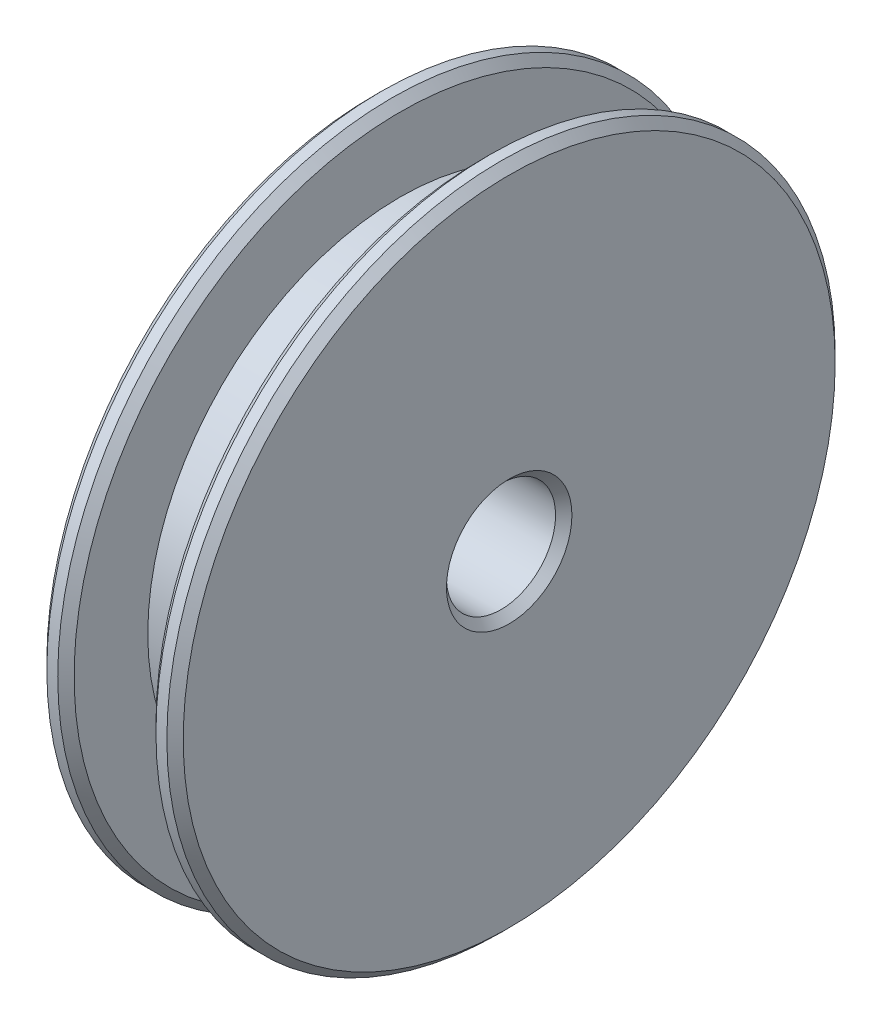
ISO-10303-21;
HEADER;
FILE_DESCRIPTION(('STEP AP214'),'2;1');
FILE_NAME('part.step','',(''),(''),'','','');
FILE_SCHEMA(('AUTOMOTIVE_DESIGN { 1 0 10303 214 1 1 1 1 }'));
ENDSEC;
DATA;
#1=APPLICATION_CONTEXT('core data for automotive mechanical design processes');
#2=APPLICATION_PROTOCOL_DEFINITION('international standard','automotive_design',2000,#1);
#3=PRODUCT_CONTEXT('',#1,'mechanical');
#4=PRODUCT('Part','Part','',(#3));
#5=PRODUCT_RELATED_PRODUCT_CATEGORY('part','',(#4));
#6=PRODUCT_DEFINITION_FORMATION('','',#4);
#7=PRODUCT_DEFINITION_CONTEXT('part definition',#1,'design');
#8=PRODUCT_DEFINITION('design','',#6,#7);
#9=PRODUCT_DEFINITION_SHAPE('','',#8);
#10=(LENGTH_UNIT() NAMED_UNIT(*) SI_UNIT(.MILLI.,.METRE.));
#11=(NAMED_UNIT(*) PLANE_ANGLE_UNIT() SI_UNIT($,.RADIAN.));
#12=(NAMED_UNIT(*) SI_UNIT($,.STERADIAN.) SOLID_ANGLE_UNIT());
#13=UNCERTAINTY_MEASURE_WITH_UNIT(LENGTH_MEASURE(1.E-05),#10,'distance_accuracy_value','');
#14=(GEOMETRIC_REPRESENTATION_CONTEXT(3) GLOBAL_UNCERTAINTY_ASSIGNED_CONTEXT((#13)) GLOBAL_UNIT_ASSIGNED_CONTEXT((#10,
#11,#12)) REPRESENTATION_CONTEXT('',''));
#15=CARTESIAN_POINT('',(0.,0.,0.));
#16=DIRECTION('',(0.,0.,1.));
#17=DIRECTION('',(1.,0.,0.));
#18=AXIS2_PLACEMENT_3D('',#15,#16,#17);
#19=CARTESIAN_POINT('',(0.,0.,0.));
#20=DIRECTION('',(-1.,0.,0.));
#21=DIRECTION('',(0.,0.,1.));
#22=AXIS2_PLACEMENT_3D('',#19,#20,#21);
#23=CYLINDRICAL_SURFACE('',#22,2.);
#24=CARTESIAN_POINT('',(9.19999999999999,0.,0.));
#25=DIRECTION('',(1.,0.,0.));
#26=DIRECTION('',(0.,0.,-1.));
#27=AXIS2_PLACEMENT_3D('',#24,#25,#26);
#28=CIRCLE('',#27,2.);
#29=CARTESIAN_POINT('',(9.19999999999999,0.,-2.));
#30=VERTEX_POINT('',#29);
#31=EDGE_CURVE('E170',#30,#30,#28,.T.);
#32=ORIENTED_EDGE('',*,*,#31,.T.);
#33=EDGE_LOOP('',(#32));
#34=FACE_BOUND('',#33,.T.);
#35=CARTESIAN_POINT('',(0.299999999999993,0.,0.));
#36=DIRECTION('',(1.,0.,0.));
#37=DIRECTION('',(0.,0.,-1.));
#38=AXIS2_PLACEMENT_3D('',#35,#36,#37);
#39=CIRCLE('',#38,2.);
#40=CARTESIAN_POINT('',(0.299999999999993,0.,-2.));
#41=VERTEX_POINT('',#40);
#42=EDGE_CURVE('E173',#41,#41,#39,.F.);
#43=ORIENTED_EDGE('',*,*,#42,.T.);
#44=EDGE_LOOP('',(#43));
#45=FACE_BOUND('',#44,.T.);
#46=CARTESIAN_POINT('',(7.85,0.,2.));
#47=CARTESIAN_POINT('',(7.84999485531506,-0.0454533691956192,1.99999610298521));
#48=CARTESIAN_POINT('',(7.84633260902487,-0.0909741237724375,1.99843267814324));
#49=CARTESIAN_POINT('',(7.8318155696716,-0.180721908730682,1.99232931963373));
#50=CARTESIAN_POINT('',(7.82094242990579,-0.224945337836552,1.9877817938186));
#51=CARTESIAN_POINT('',(7.79248120753885,-0.310651709191418,1.97619800288383));
#52=CARTESIAN_POINT('',(7.77491624354067,-0.352143516101832,1.96917031221161));
#53=CARTESIAN_POINT('',(7.73366735607275,-0.431549996691369,1.95330651712269));
#54=CARTESIAN_POINT('',(7.70998514923173,-0.469465669841503,1.94447092018736));
#55=CARTESIAN_POINT('',(7.65587976052907,-0.542669435590061,1.92535926070784));
#56=CARTESIAN_POINT('',(7.62519048713297,-0.577748101128574,1.91503480140104));
#57=CARTESIAN_POINT('',(7.55850533801077,-0.642442127963505,1.89431367403256));
#58=CARTESIAN_POINT('',(7.52250658187128,-0.672054504020533,1.88391696971344));
#59=CARTESIAN_POINT('',(7.44397163283228,-0.726489570806992,1.86362579212524));
#60=CARTESIAN_POINT('',(7.4011937614794,-0.750985724786075,1.85378502511931));
#61=CARTESIAN_POINT('',(7.31164689847335,-0.792341264830012,1.8364916311108));
#62=CARTESIAN_POINT('',(7.26488006051391,-0.809204741243102,1.8290377256183));
#63=CARTESIAN_POINT('',(7.17109370782744,-0.833942550523084,1.81788799782102));
#64=CARTESIAN_POINT('',(7.12420148777963,-0.842220821052611,1.81402429269854));
#65=CARTESIAN_POINT('',(7.02954668703068,-0.850812404303666,1.81001192331652));
#66=CARTESIAN_POINT('',(6.98178463096778,-0.851130368787563,1.80986108936811));
#67=CARTESIAN_POINT('',(6.89084638594808,-0.844095650813446,1.81315001237071));
#68=CARTESIAN_POINT('',(6.84761013946082,-0.837357397996349,1.81630217082056));
#69=CARTESIAN_POINT('',(6.76295289579606,-0.817435293190567,1.82535420422441));
#70=CARTESIAN_POINT('',(6.72153226489487,-0.804250147088479,1.83125463083916));
#71=CARTESIAN_POINT('',(6.64061459061202,-0.7715494237797,1.84527304709129));
#72=CARTESIAN_POINT('',(6.60117868257091,-0.751902856907674,1.85343632082439));
#73=CARTESIAN_POINT('',(6.52600594482056,-0.706930007631809,1.87105111673329));
#74=CARTESIAN_POINT('',(6.49027061447246,-0.681601436111337,1.88050315751273));
#75=CARTESIAN_POINT('',(6.42019348079294,-0.623360722197447,1.90064484729978));
#76=CARTESIAN_POINT('',(6.38625307307955,-0.589976546572498,1.91137009611481));
#77=CARTESIAN_POINT('',(6.32431473044174,-0.517888341795048,1.93214852473557));
#78=CARTESIAN_POINT('',(6.2963183012143,-0.479182968786319,1.94220153381236));
#79=CARTESIAN_POINT('',(6.24644123471822,-0.396289225002726,1.96081645134392));
#80=CARTESIAN_POINT('',(6.22473019433377,-0.351988346324726,1.96933501020278));
#81=CARTESIAN_POINT('',(6.18921099916799,-0.25990826771039,1.98358575052622));
#82=CARTESIAN_POINT('',(6.17539829563028,-0.212131087731184,1.98931953549159));
#83=CARTESIAN_POINT('',(6.15692262036468,-0.117803605483454,1.99705138766422));
#84=CARTESIAN_POINT('',(6.15172135916805,-0.0713767168908719,1.99926883018934));
#85=CARTESIAN_POINT('',(6.1490035610588,0.0217359650488923,2.00042313259768));
#86=CARTESIAN_POINT('',(6.1514847031591,0.0684216759473159,1.99936098330267));
#87=CARTESIAN_POINT('',(6.16368160827693,0.15816406305469,1.99421689879685));
#88=CARTESIAN_POINT('',(6.17301383752975,0.201283108380667,1.99029512539326));
#89=CARTESIAN_POINT('',(6.19810806385209,0.285292826143489,1.98000006016052));
#90=CARTESIAN_POINT('',(6.21387086485905,0.326183219233778,1.97362646181472));
#91=CARTESIAN_POINT('',(6.25189170509613,0.406017159274118,1.95878809411181));
#92=CARTESIAN_POINT('',(6.27433702119993,0.444860185104721,1.9502642938807));
#93=CARTESIAN_POINT('',(6.32488069927335,0.518368244124496,1.93202768317616));
#94=CARTESIAN_POINT('',(6.35298145989243,0.55303149453183,1.92231436887961));
#95=CARTESIAN_POINT('',(6.4164749242142,0.619902104784065,1.90184999483242));
#96=CARTESIAN_POINT('',(6.45225399178763,0.651736359196346,1.89107541423886));
#97=CARTESIAN_POINT('',(6.52880770509276,0.709059266407625,1.87033858424291));
#98=CARTESIAN_POINT('',(6.56958365649981,0.734546255381553,1.8603765482942));
#99=CARTESIAN_POINT('',(6.65594100823478,0.77879063756575,1.84229973935975));
#100=CARTESIAN_POINT('',(6.70159161560414,0.797427815218113,1.83421880198126));
#101=CARTESIAN_POINT('',(6.79583611113618,0.826586075766017,1.82126733168343));
#102=CARTESIAN_POINT('',(6.84442739974756,0.837114217174601,1.81639400723519));
#103=CARTESIAN_POINT('',(6.93901705018618,0.849040893251798,1.81084755056649));
#104=CARTESIAN_POINT('',(6.98491493498965,0.851097972334276,1.80987163394732));
#105=CARTESIAN_POINT('',(7.07637814740052,0.847796714926126,1.8114205168628));
#106=CARTESIAN_POINT('',(7.12194352994133,0.842439632567223,1.81394472433919));
#107=CARTESIAN_POINT('',(7.20907718878752,0.825022602727582,1.82192797471859));
#108=CARTESIAN_POINT('',(7.25073119067697,0.813313907363117,1.82723276934342));
#109=CARTESIAN_POINT('',(7.33148903296141,0.783877255858317,1.84005238289192));
#110=CARTESIAN_POINT('',(7.37059214711152,0.76614759437085,1.84756782786789));
#111=CARTESIAN_POINT('',(7.44776290625968,0.723920163433527,1.86453396385473));
#112=CARTESIAN_POINT('',(7.48561934646319,0.699073507320178,1.87407518241383));
#113=CARTESIAN_POINT('',(7.55683126387723,0.643795334394055,1.89377609827807));
#114=CARTESIAN_POINT('',(7.59018507322382,0.613361757872052,1.90393602275304));
#115=CARTESIAN_POINT('',(7.65409233199652,0.544992960322057,1.92466960832755));
#116=CARTESIAN_POINT('',(7.68423197173319,0.506660401940232,1.93521482698711));
#117=CARTESIAN_POINT('',(7.73767860922517,0.425096164183361,1.95475042990917));
#118=CARTESIAN_POINT('',(7.7609825072125,0.381862274509921,1.96374010803344));
#119=CARTESIAN_POINT('',(7.7996199138584,0.292319161030918,1.97903554560946));
#120=CARTESIAN_POINT('',(7.81506921093474,0.246066684743339,1.98538003116276));
#121=CARTESIAN_POINT('',(7.83781955712287,0.151373618625758,1.99482615738596));
#122=CARTESIAN_POINT('',(7.84514593214634,0.102940322491203,1.99793787536247));
#123=CARTESIAN_POINT('',(7.84942364590889,0.0362062000322417,1.9997555776352));
#124=CARTESIAN_POINT('',(7.85000204962272,0.018108447703111,2.00000155255573));
#125=CARTESIAN_POINT('',(7.85,0.,2.));
#126=B_SPLINE_CURVE_WITH_KNOTS('',3,(#46,#47,#48,#49,#50,#51,#52,#53,#54,#55,#56,#57,#58,#59,
#60,#61,#62,#63,#64,#65,#66,#67,#68,#69,#70,#71,#72,#73,#74,#75,#76,#77,#78,#79,#80,#81,#82,#83,
#84,#85,#86,#87,#88,#89,#90,#91,#92,#93,#94,#95,#96,#97,#98,#99,#100,#101,#102,#103,#104,#105,
#106,#107,#108,#109,#110,#111,#112,#113,#114,#115,#116,#117,#118,#119,#120,#121,#122,#123,#124,
#125),.UNSPECIFIED.,.T.,.F.,(4,2,2,2,2,2,2,2,2,2,2,2,2,2,2,2,2,2,2,2,2,2,2,2,2,2,2,2,2,2,2,2,2,
2,2,2,2,2,2,4),(0.,0.136307040293474,0.272962224477558,0.409149518129234,0.54529863616415,
0.687894487815835,0.830567984725648,0.980613328827404,1.13057816821904,1.27311370785288,
1.41556595207797,1.54656942935013,1.67759921433231,1.81146843344723,1.94539168179446,
2.09113553267629,2.23691625868103,2.3863260628409,2.53564973303489,2.67522845014003,
2.81476500221255,2.94703402435382,3.07931958757823,3.21573173032308,3.35220185208167,
3.49879868489879,3.64543390516936,3.7945319186785,3.94350000264553,4.08063948476886,
4.21775577209704,4.34796480873199,4.47821075589872,4.6164584845508,4.75475728320955,
4.90371253229748,5.05273522328959,5.19949230493043,5.3457905244665,5.40009472576998),.UNSPECIFIED.);
#127=CARTESIAN_POINT('',(7.85,0.,2.));
#128=VERTEX_POINT('',#127);
#129=EDGE_CURVE('E190',#128,#128,#126,.T.);
#130=ORIENTED_EDGE('',*,*,#129,.F.);
#131=EDGE_LOOP('',(#130));
#132=FACE_BOUND('',#131,.T.);
#133=ADVANCED_FACE('F132',(#34,#45,#132),#23,.F.);
#134=CARTESIAN_POINT('',(2.33899178982258,0.,0.));
#135=DIRECTION('',(-1.,0.,0.));
#136=DIRECTION('',(0.,0.,1.));
#137=AXIS2_PLACEMENT_3D('',#134,#135,#136);
#138=CYLINDRICAL_SURFACE('',#137,9.25);
#139=CARTESIAN_POINT('',(5.5,0.,0.));
#140=DIRECTION('',(-1.,0.,0.));
#141=DIRECTION('',(0.,0.,1.));
#142=AXIS2_PLACEMENT_3D('',#139,#140,#141);
#143=CIRCLE('',#142,9.25);
#144=CARTESIAN_POINT('',(5.5,0.,9.25));
#145=VERTEX_POINT('',#144);
#146=EDGE_CURVE('E255',#145,#145,#143,.T.);
#147=ORIENTED_EDGE('',*,*,#146,.F.);
#148=EDGE_LOOP('',(#147));
#149=FACE_BOUND('',#148,.T.);
#150=CARTESIAN_POINT('',(8.5,0.,0.));
#151=DIRECTION('',(-1.,0.,0.));
#152=DIRECTION('',(0.,0.,1.));
#153=AXIS2_PLACEMENT_3D('',#150,#151,#152);
#154=CIRCLE('',#153,9.25);
#155=CARTESIAN_POINT('',(8.5,0.,9.25));
#156=VERTEX_POINT('',#155);
#157=EDGE_CURVE('E211',#156,#156,#154,.T.);
#158=ORIENTED_EDGE('',*,*,#157,.T.);
#159=EDGE_LOOP('',(#158));
#160=FACE_BOUND('',#159,.T.);
#161=CARTESIAN_POINT('',(7.85,0.,9.25));
#162=CARTESIAN_POINT('',(7.84999792776888,-0.0476370846732466,9.24999949222256));
#163=CARTESIAN_POINT('',(7.84598189077624,-0.0953061404503285,9.24962808998843));
#164=CARTESIAN_POINT('',(7.83002099415769,-0.189324036851098,9.24818220410719));
#165=CARTESIAN_POINT('',(7.81806727317002,-0.235671341538837,9.24710693470568));
#166=CARTESIAN_POINT('',(7.78658075080506,-0.32567055159058,9.24437476036882));
#167=CARTESIAN_POINT('',(7.76705238001349,-0.369324015374126,9.24271819550035));
#168=CARTESIAN_POINT('',(7.72097916066193,-0.452723509936903,9.23900893875692));
#169=CARTESIAN_POINT('',(7.69443576100248,-0.492470345277323,9.23695632870566));
#170=CARTESIAN_POINT('',(7.6349984070634,-0.567060120939312,9.23267808063553));
#171=CARTESIAN_POINT('',(7.60208736641374,-0.601889420980146,9.23045198692563));
#172=CARTESIAN_POINT('',(7.53088525103166,-0.665538307976645,9.22608146208895));
#173=CARTESIAN_POINT('',(7.49259393405423,-0.694357624189745,9.2239370346447));
#174=CARTESIAN_POINT('',(7.41163413275954,-0.745215788343305,9.21996787730021));
#175=CARTESIAN_POINT('',(7.36895796795899,-0.76724245878165,9.21814372406245));
#176=CARTESIAN_POINT('',(7.28049328194995,-0.803812306017037,9.2150271081286));
#177=CARTESIAN_POINT('',(7.23470482646198,-0.818355640779976,9.2137346342094));
#178=CARTESIAN_POINT('',(7.1414533333211,-0.839505950963499,9.21183170543771));
#179=CARTESIAN_POINT('',(7.09399542565822,-0.846135368093439,9.21121932237905));
#180=CARTESIAN_POINT('',(6.99863686453393,-0.851339008390021,9.21073987705125));
#181=CARTESIAN_POINT('',(6.95073622103734,-0.84991341241558,9.21087279804782));
#182=CARTESIAN_POINT('',(6.85600614717573,-0.839066015658612,9.21186718536504));
#183=CARTESIAN_POINT('',(6.80917389098237,-0.829668659981251,9.21272642442989));
#184=CARTESIAN_POINT('',(6.7177541619531,-0.80318250681332,9.2150731476958));
#185=CARTESIAN_POINT('',(6.67316671518585,-0.786093620024984,9.21656063919077));
#186=CARTESIAN_POINT('',(6.58742471043244,-0.744682315718184,9.21999882913122));
#187=CARTESIAN_POINT('',(6.54627544961112,-0.720348990700538,9.22195022514972));
#188=CARTESIAN_POINT('',(6.46863583953017,-0.665147393901243,9.22609573560569));
#189=CARTESIAN_POINT('',(6.4321456053033,-0.63427896081581,9.22828985603359));
#190=CARTESIAN_POINT('',(6.3647177788951,-0.566746565367757,9.23268351161205));
#191=CARTESIAN_POINT('',(6.33380133730989,-0.53006148055265,9.23488303656137));
#192=CARTESIAN_POINT('',(6.27856242927357,-0.452010657179427,9.23903193339905));
#193=CARTESIAN_POINT('',(6.25423996858449,-0.41064491453125,9.24098130506882));
#194=CARTESIAN_POINT('',(6.21288053439215,-0.324392803975308,9.24441075330544));
#195=CARTESIAN_POINT('',(6.1958445645894,-0.279505952048454,9.2458907652116));
#196=CARTESIAN_POINT('',(6.1695568487732,-0.187492399736341,9.2482140398282));
#197=CARTESIAN_POINT('',(6.16030490627145,-0.140365755920758,9.24905731861133));
#198=CARTESIAN_POINT('',(6.14987454588273,-0.0453936206943293,9.25001004942673));
#199=CARTESIAN_POINT('',(6.14866692741954,0.00244863825002978,9.25012215555564));
#200=CARTESIAN_POINT('',(6.15428290180991,0.0976548975945362,9.24960701224893));
#201=CARTESIAN_POINT('',(6.16110640329972,0.145018903429211,9.24897977122429));
#202=CARTESIAN_POINT('',(6.18256670965705,0.237840404669015,9.24705814915379));
#203=CARTESIAN_POINT('',(6.19718991207794,0.28330107103378,9.24576492968959));
#204=CARTESIAN_POINT('',(6.23382058617286,0.371123824126125,9.24265652962257));
#205=CARTESIAN_POINT('',(6.25582819877559,0.413485851698552,9.24084133905823));
#206=CARTESIAN_POINT('',(6.30667588584271,0.494041289277799,9.23688564547915));
#207=CARTESIAN_POINT('',(6.33553522683663,0.532222492542615,9.23474423134656));
#208=CARTESIAN_POINT('',(6.39923943027125,0.603209069334763,9.23037952046517));
#209=CARTESIAN_POINT('',(6.43408441928737,0.636014329151113,9.22815622198557));
#210=CARTESIAN_POINT('',(6.50889785533252,0.695418563850993,9.22387040046341));
#211=CARTESIAN_POINT('',(6.54888150872717,0.721998429645741,9.22180838506019));
#212=CARTESIAN_POINT('',(6.63276193314079,0.768066180954811,9.21808606850965));
#213=CARTESIAN_POINT('',(6.67665865791947,0.787554150259378,9.21642576261623));
#214=CARTESIAN_POINT('',(6.76705254204956,0.818852640161989,9.21369787286049));
#215=CARTESIAN_POINT('',(6.81354567896371,0.830674697263945,9.21262939869995));
#216=CARTESIAN_POINT('',(6.90786732315413,0.846343276586317,9.21120328398292));
#217=CARTESIAN_POINT('',(6.95569579857248,0.85018998891447,9.21084562648274));
#218=CARTESIAN_POINT('',(7.05114053264695,0.849796274447336,9.21088194465917));
#219=CARTESIAN_POINT('',(7.09875691906342,0.84558586827335,9.21127313016742));
#220=CARTESIAN_POINT('',(7.19260305597119,0.82926020374282,9.21275711944008));
#221=CARTESIAN_POINT('',(7.23883280460083,0.817144934773928,9.21384992414641));
#222=CARTESIAN_POINT('',(7.32859423752347,0.785361399650265,9.21661326722427));
#223=CARTESIAN_POINT('',(7.37212617581526,0.765693845801492,9.21828375110958));
#224=CARTESIAN_POINT('',(7.45527552482868,0.719367239060225,9.22201433698682));
#225=CARTESIAN_POINT('',(7.49489297750478,0.692708261111239,9.22407443480228));
#226=CARTESIAN_POINT('',(7.56924256209657,0.633042689391483,9.22836129630614));
#227=CARTESIAN_POINT('',(7.6039567515893,0.600013778082753,9.23058862864503));
#228=CARTESIAN_POINT('',(7.66736412194514,0.528588559541346,9.23495378857713));
#229=CARTESIAN_POINT('',(7.69605585129989,0.490190962076994,9.2370915944939));
#230=CARTESIAN_POINT('',(7.74665118571887,0.409028933190393,9.24104152502463));
#231=CARTESIAN_POINT('',(7.76853985555525,0.366255164087783,9.24285292945669));
#232=CARTESIAN_POINT('',(7.80479571759602,0.277651026926508,9.24593785945556));
#233=CARTESIAN_POINT('',(7.81917147461022,0.231824206904294,9.24721199719118));
#234=CARTESIAN_POINT('',(7.83636972667363,0.154776930048339,9.24875514108906));
#235=CARTESIAN_POINT('',(7.84147419257583,0.124050560039465,9.24921981272009));
#236=CARTESIAN_POINT('',(7.84829000035717,0.0622206730630395,9.24984240750493));
#237=CARTESIAN_POINT('',(7.85000135360806,0.0311171573598129,9.25000033168677));
#238=CARTESIAN_POINT('',(7.85,0.,9.25));
#239=B_SPLINE_CURVE_WITH_KNOTS('',3,(#161,#162,#163,#164,#165,#166,#167,#168,#169,#170,#171,
#172,#173,#174,#175,#176,#177,#178,#179,#180,#181,#182,#183,#184,#185,#186,#187,#188,#189,#190,
#191,#192,#193,#194,#195,#196,#197,#198,#199,#200,#201,#202,#203,#204,#205,#206,#207,#208,#209,
#210,#211,#212,#213,#214,#215,#216,#217,#218,#219,#220,#221,#222,#223,#224,#225,#226,#227,#228,
#229,#230,#231,#232,#233,#234,#235,#236,#237,#238),.UNSPECIFIED.,.T.,.F.,(4,2,2,2,2,2,2,2,2,2,2,
2,2,2,2,2,2,2,2,2,2,2,2,2,2,2,2,2,2,2,2,2,2,2,2,2,2,2,4),(0.,0.142797634317748,
0.285754951690397,0.428628775854004,0.571473113553022,0.714706200527788,0.857945738588177,
1.00144059591486,1.14493242408117,1.2880163746202,1.43109711251326,1.573740678081,
1.71638589976642,1.85924698908744,2.00211160500987,2.14550742712782,2.28890337454915,
2.43231906813746,2.57573114144636,2.71862234960822,2.86151193222479,3.00415313055653,
3.14679705129684,3.28984692809645,3.4328998302707,3.57638624669538,3.71987096778339,
3.86313925311516,4.00640412333154,4.14913623141389,4.29186853111575,4.43458737209443,
4.5773046832827,4.72053140987001,4.86379261683258,5.0073661490239,5.15077564666699,
5.24405321350629,5.33733046773276),.UNSPECIFIED.);
#240=CARTESIAN_POINT('',(7.85,0.,9.25));
#241=VERTEX_POINT('',#240);
#242=EDGE_CURVE('E183',#241,#241,#239,.T.);
#243=ORIENTED_EDGE('',*,*,#242,.T.);
#244=EDGE_LOOP('',(#243));
#245=FACE_BOUND('',#244,.T.);
#246=ADVANCED_FACE('F192',(#149,#160,#245),#138,.T.);
#247=CARTESIAN_POINT('',(0.,0.,0.));
#248=DIRECTION('',(-1.,0.,0.));
#249=DIRECTION('',(0.,0.,1.));
#250=AXIS2_PLACEMENT_3D('',#247,#248,#249);
#251=CYLINDRICAL_SURFACE('',#250,4.5);
#252=CARTESIAN_POINT('',(0.299999999999998,0.,0.));
#253=DIRECTION('',(1.,0.,0.));
#254=DIRECTION('',(0.,0.,-1.));
#255=AXIS2_PLACEMENT_3D('',#252,#253,#254);
#256=CIRCLE('',#255,4.5);
#257=CARTESIAN_POINT('',(0.299999999999998,0.,-4.5));
#258=VERTEX_POINT('',#257);
#259=EDGE_CURVE('E161',#258,#258,#256,.T.);
#260=ORIENTED_EDGE('',*,*,#259,.T.);
#261=EDGE_LOOP('',(#260));
#262=FACE_BOUND('',#261,.T.);
#263=CARTESIAN_POINT('',(4.5,0.,0.));
#264=DIRECTION('',(-1.,0.,0.));
#265=DIRECTION('',(0.,0.,1.));
#266=AXIS2_PLACEMENT_3D('',#263,#264,#265);
#267=CIRCLE('',#266,4.5);
#268=CARTESIAN_POINT('',(4.5,0.,4.5));
#269=VERTEX_POINT('',#268);
#270=EDGE_CURVE('E182',#269,#269,#267,.F.);
#271=ORIENTED_EDGE('',*,*,#270,.F.);
#272=EDGE_LOOP('',(#271));
#273=FACE_BOUND('',#272,.T.);
#274=ADVANCED_FACE('F264',(#262,#273),#251,.T.);
#275=CARTESIAN_POINT('',(0.,4.5,0.));
#276=DIRECTION('',(1.,0.,0.));
#277=DIRECTION('',(0.,0.,-1.));
#278=AXIS2_PLACEMENT_3D('',#275,#276,#277);
#279=PLANE('',#278);
#280=CARTESIAN_POINT('',(0.,0.,0.));
#281=DIRECTION('',(1.,0.,0.));
#282=DIRECTION('',(0.,0.,-1.));
#283=AXIS2_PLACEMENT_3D('',#280,#281,#282);
#284=CIRCLE('',#283,2.3);
#285=CARTESIAN_POINT('',(0.,0.,-2.3));
#286=VERTEX_POINT('',#285);
#287=EDGE_CURVE('E164',#286,#286,#284,.T.);
#288=ORIENTED_EDGE('',*,*,#287,.T.);
#289=EDGE_LOOP('',(#288));
#290=FACE_BOUND('',#289,.T.);
#291=CARTESIAN_POINT('',(0.,0.,0.));
#292=DIRECTION('',(1.,0.,0.));
#293=DIRECTION('',(0.,0.,-1.));
#294=AXIS2_PLACEMENT_3D('',#291,#292,#293);
#295=CIRCLE('',#294,4.2);
#296=CARTESIAN_POINT('',(0.,0.,-4.2));
#297=VERTEX_POINT('',#296);
#298=EDGE_CURVE('E167',#297,#297,#295,.F.);
#299=ORIENTED_EDGE('',*,*,#298,.T.);
#300=EDGE_LOOP('',(#299));
#301=FACE_BOUND('',#300,.T.);
#302=ADVANCED_FACE('F217',(#290,#301),#279,.F.);
#303=CARTESIAN_POINT('',(4.5,0.,4.));
#304=DIRECTION('',(-1.,0.,0.));
#305=DIRECTION('',(0.,0.,1.));
#306=AXIS2_PLACEMENT_3D('',#303,#304,#305);
#307=PLANE('',#306);
#308=CARTESIAN_POINT('',(4.5,0.,0.));
#309=DIRECTION('',(-1.,0.,0.));
#310=DIRECTION('',(0.,0.,1.));
#311=AXIS2_PLACEMENT_3D('',#308,#309,#310);
#312=CIRCLE('',#311,11.95);
#313=CARTESIAN_POINT('',(4.5,0.,11.95));
#314=VERTEX_POINT('',#313);
#315=EDGE_CURVE('E147',#314,#314,#312,.T.);
#316=ORIENTED_EDGE('',*,*,#315,.T.);
#317=EDGE_LOOP('',(#316));
#318=FACE_BOUND('',#317,.T.);
#319=ORIENTED_EDGE('',*,*,#270,.T.);
#320=EDGE_LOOP('',(#319));
#321=FACE_BOUND('',#320,.T.);
#322=ADVANCED_FACE('F262',(#318,#321),#307,.T.);
#323=CARTESIAN_POINT('',(2.33899178982258,0.,0.));
#324=DIRECTION('',(-1.,0.,0.));
#325=DIRECTION('',(0.,0.,1.));
#326=AXIS2_PLACEMENT_3D('',#323,#324,#325);
#327=CYLINDRICAL_SURFACE('',#326,12.25);
#328=CARTESIAN_POINT('',(5.2,0.,0.));
#329=DIRECTION('',(1.,0.,0.));
#330=DIRECTION('',(0.,0.,-1.));
#331=AXIS2_PLACEMENT_3D('',#328,#329,#330);
#332=CIRCLE('',#331,12.25);
#333=CARTESIAN_POINT('',(5.2,0.,-12.25));
#334=VERTEX_POINT('',#333);
#335=EDGE_CURVE('E155',#334,#334,#332,.F.);
#336=ORIENTED_EDGE('',*,*,#335,.T.);
#337=EDGE_LOOP('',(#336));
#338=FACE_BOUND('',#337,.T.);
#339=CARTESIAN_POINT('',(4.8,0.,0.));
#340=DIRECTION('',(-1.,0.,0.));
#341=DIRECTION('',(0.,0.,1.));
#342=AXIS2_PLACEMENT_3D('',#339,#340,#341);
#343=CIRCLE('',#342,12.25);
#344=CARTESIAN_POINT('',(4.8,0.,12.25));
#345=VERTEX_POINT('',#344);
#346=EDGE_CURVE('E158',#345,#345,#343,.F.);
#347=ORIENTED_EDGE('',*,*,#346,.T.);
#348=EDGE_LOOP('',(#347));
#349=FACE_BOUND('',#348,.T.);
#350=ADVANCED_FACE('F276',(#338,#349),#327,.T.);
#351=CARTESIAN_POINT('',(5.5,0.,12.25));
#352=DIRECTION('',(1.,0.,0.));
#353=DIRECTION('',(0.,0.,-1.));
#354=AXIS2_PLACEMENT_3D('',#351,#352,#353);
#355=PLANE('',#354);
#356=CARTESIAN_POINT('',(5.5,0.,0.));
#357=DIRECTION('',(1.,0.,0.));
#358=DIRECTION('',(0.,0.,-1.));
#359=AXIS2_PLACEMENT_3D('',#356,#357,#358);
#360=CIRCLE('',#359,11.95);
#361=CARTESIAN_POINT('',(5.5,0.,-11.95));
#362=VERTEX_POINT('',#361);
#363=EDGE_CURVE('E152',#362,#362,#360,.T.);
#364=ORIENTED_EDGE('',*,*,#363,.T.);
#365=EDGE_LOOP('',(#364));
#366=FACE_BOUND('',#365,.T.);
#367=ORIENTED_EDGE('',*,*,#146,.T.);
#368=EDGE_LOOP('',(#367));
#369=FACE_BOUND('',#368,.T.);
#370=ADVANCED_FACE('F251',(#366,#369),#355,.T.);
#371=CARTESIAN_POINT('',(8.5,0.,9.25));
#372=DIRECTION('',(-1.,0.,0.));
#373=DIRECTION('',(0.,0.,1.));
#374=AXIS2_PLACEMENT_3D('',#371,#372,#373);
#375=PLANE('',#374);
#376=CARTESIAN_POINT('',(8.5,0.,0.));
#377=DIRECTION('',(-1.,0.,0.));
#378=DIRECTION('',(0.,0.,1.));
#379=AXIS2_PLACEMENT_3D('',#376,#377,#378);
#380=CIRCLE('',#379,11.95);
#381=CARTESIAN_POINT('',(8.5,0.,11.95));
#382=VERTEX_POINT('',#381);
#383=EDGE_CURVE('E143',#382,#382,#380,.T.);
#384=ORIENTED_EDGE('',*,*,#383,.T.);
#385=EDGE_LOOP('',(#384));
#386=FACE_BOUND('',#385,.T.);
#387=ORIENTED_EDGE('',*,*,#157,.F.);
#388=EDGE_LOOP('',(#387));
#389=FACE_BOUND('',#388,.T.);
#390=ADVANCED_FACE('F247',(#386,#389),#375,.T.);
#391=CARTESIAN_POINT('',(2.33899178982258,0.,0.));
#392=DIRECTION('',(-1.,0.,0.));
#393=DIRECTION('',(0.,0.,1.));
#394=AXIS2_PLACEMENT_3D('',#391,#392,#393);
#395=CYLINDRICAL_SURFACE('',#394,12.25);
#396=CARTESIAN_POINT('',(8.80000000000001,0.,0.));
#397=DIRECTION('',(-1.,0.,0.));
#398=DIRECTION('',(0.,0.,1.));
#399=AXIS2_PLACEMENT_3D('',#396,#397,#398);
#400=CIRCLE('',#399,12.25);
#401=CARTESIAN_POINT('',(8.80000000000001,0.,12.25));
#402=VERTEX_POINT('',#401);
#403=EDGE_CURVE('E11',#402,#402,#400,.F.);
#404=ORIENTED_EDGE('',*,*,#403,.T.);
#405=EDGE_LOOP('',(#404));
#406=FACE_BOUND('',#405,.T.);
#407=CARTESIAN_POINT('',(9.20000000000001,0.,0.));
#408=DIRECTION('',(1.,0.,0.));
#409=DIRECTION('',(0.,0.,-1.));
#410=AXIS2_PLACEMENT_3D('',#407,#408,#409);
#411=CIRCLE('',#410,12.25);
#412=CARTESIAN_POINT('',(9.20000000000001,0.,-12.25));
#413=VERTEX_POINT('',#412);
#414=EDGE_CURVE('E139',#413,#413,#411,.F.);
#415=ORIENTED_EDGE('',*,*,#414,.T.);
#416=EDGE_LOOP('',(#415));
#417=FACE_BOUND('',#416,.T.);
#418=ADVANCED_FACE('F250',(#406,#417),#395,.T.);
#419=CARTESIAN_POINT('',(9.5,0.,12.25));
#420=DIRECTION('',(1.,0.,0.));
#421=DIRECTION('',(0.,0.,-1.));
#422=AXIS2_PLACEMENT_3D('',#419,#420,#421);
#423=PLANE('',#422);
#424=CARTESIAN_POINT('',(9.5,0.,0.));
#425=DIRECTION('',(1.,0.,0.));
#426=DIRECTION('',(0.,0.,-1.));
#427=AXIS2_PLACEMENT_3D('',#424,#425,#426);
#428=CIRCLE('',#427,2.30000000000001);
#429=CARTESIAN_POINT('',(9.5,0.,-2.30000000000001));
#430=VERTEX_POINT('',#429);
#431=EDGE_CURVE('E176',#430,#430,#428,.F.);
#432=ORIENTED_EDGE('',*,*,#431,.T.);
#433=EDGE_LOOP('',(#432));
#434=FACE_BOUND('',#433,.T.);
#435=CARTESIAN_POINT('',(9.5,0.,0.));
#436=DIRECTION('',(1.,0.,0.));
#437=DIRECTION('',(0.,0.,-1.));
#438=AXIS2_PLACEMENT_3D('',#435,#436,#437);
#439=CIRCLE('',#438,11.95);
#440=CARTESIAN_POINT('',(9.5,0.,-11.95));
#441=VERTEX_POINT('',#440);
#442=EDGE_CURVE('E179',#441,#441,#439,.T.);
#443=ORIENTED_EDGE('',*,*,#442,.T.);
#444=EDGE_LOOP('',(#443));
#445=FACE_BOUND('',#444,.T.);
#446=ADVANCED_FACE('F201',(#434,#445),#423,.T.);
#447=CARTESIAN_POINT('',(7.,0.,30.));
#448=DIRECTION('',(0.,0.,-1.));
#449=DIRECTION('',(-1.,0.,0.));
#450=AXIS2_PLACEMENT_3D('',#447,#448,#449);
#451=CYLINDRICAL_SURFACE('',#450,0.849999999999999);
#452=ORIENTED_EDGE('',*,*,#242,.F.);
#453=EDGE_LOOP('',(#452));
#454=FACE_BOUND('',#453,.T.);
#455=ORIENTED_EDGE('',*,*,#129,.T.);
#456=EDGE_LOOP('',(#455));
#457=FACE_BOUND('',#456,.T.);
#458=ADVANCED_FACE('F196',(#454,#457),#451,.F.);
#459=CARTESIAN_POINT('',(9.5,0.,0.));
#460=DIRECTION('',(1.,0.,0.));
#461=DIRECTION('',(0.,0.,-1.));
#462=AXIS2_PLACEMENT_3D('',#459,#460,#461);
#463=CONICAL_SURFACE('',#462,2.30000000000001,0.785398163397451);
#464=ORIENTED_EDGE('',*,*,#31,.F.);
#465=EDGE_LOOP('',(#464));
#466=FACE_BOUND('',#465,.T.);
#467=ORIENTED_EDGE('',*,*,#431,.F.);
#468=EDGE_LOOP('',(#467));
#469=FACE_BOUND('',#468,.T.);
#470=ADVANCED_FACE('F200',(#466,#469),#463,.F.);
#471=CARTESIAN_POINT('',(0.299999999999993,0.,0.));
#472=DIRECTION('',(-1.,0.,0.));
#473=DIRECTION('',(0.,0.,1.));
#474=AXIS2_PLACEMENT_3D('',#471,#472,#473);
#475=CONICAL_SURFACE('',#474,2.,0.785398163397454);
#476=ORIENTED_EDGE('',*,*,#287,.F.);
#477=EDGE_LOOP('',(#476));
#478=FACE_BOUND('',#477,.T.);
#479=ORIENTED_EDGE('',*,*,#42,.F.);
#480=EDGE_LOOP('',(#479));
#481=FACE_BOUND('',#480,.T.);
#482=ADVANCED_FACE('F221',(#478,#481),#475,.F.);
#483=CARTESIAN_POINT('',(0.299999999999998,0.,0.));
#484=DIRECTION('',(1.,0.,0.));
#485=DIRECTION('',(0.,0.,-1.));
#486=AXIS2_PLACEMENT_3D('',#483,#484,#485);
#487=CONICAL_SURFACE('',#486,4.5,0.785398163397451);
#488=ORIENTED_EDGE('',*,*,#298,.F.);
#489=EDGE_LOOP('',(#488));
#490=FACE_BOUND('',#489,.T.);
#491=ORIENTED_EDGE('',*,*,#259,.F.);
#492=EDGE_LOOP('',(#491));
#493=FACE_BOUND('',#492,.T.);
#494=ADVANCED_FACE('F225',(#490,#493),#487,.T.);
#495=CARTESIAN_POINT('',(5.2,0.,0.));
#496=DIRECTION('',(-1.,0.,0.));
#497=DIRECTION('',(0.,0.,1.));
#498=AXIS2_PLACEMENT_3D('',#495,#496,#497);
#499=CONICAL_SURFACE('',#498,12.25,0.785398163397451);
#500=ORIENTED_EDGE('',*,*,#363,.F.);
#501=EDGE_LOOP('',(#500));
#502=FACE_BOUND('',#501,.T.);
#503=ORIENTED_EDGE('',*,*,#335,.F.);
#504=EDGE_LOOP('',(#503));
#505=FACE_BOUND('',#504,.T.);
#506=ADVANCED_FACE('F229',(#502,#505),#499,.T.);
#507=CARTESIAN_POINT('',(4.5,0.,0.));
#508=DIRECTION('',(1.,0.,0.));
#509=DIRECTION('',(0.,0.,-1.));
#510=AXIS2_PLACEMENT_3D('',#507,#508,#509);
#511=CONICAL_SURFACE('',#510,11.95,0.785398163397448);
#512=ORIENTED_EDGE('',*,*,#346,.F.);
#513=EDGE_LOOP('',(#512));
#514=FACE_BOUND('',#513,.T.);
#515=ORIENTED_EDGE('',*,*,#315,.F.);
#516=EDGE_LOOP('',(#515));
#517=FACE_BOUND('',#516,.T.);
#518=ADVANCED_FACE('F233',(#514,#517),#511,.T.);
#519=CARTESIAN_POINT('',(8.5,0.,0.));
#520=DIRECTION('',(1.,0.,0.));
#521=DIRECTION('',(0.,0.,-1.));
#522=AXIS2_PLACEMENT_3D('',#519,#520,#521);
#523=CONICAL_SURFACE('',#522,11.95,0.785398163397443);
#524=ORIENTED_EDGE('',*,*,#403,.F.);
#525=EDGE_LOOP('',(#524));
#526=FACE_BOUND('',#525,.T.);
#527=ORIENTED_EDGE('',*,*,#383,.F.);
#528=EDGE_LOOP('',(#527));
#529=FACE_BOUND('',#528,.T.);
#530=ADVANCED_FACE('F236',(#526,#529),#523,.T.);
#531=CARTESIAN_POINT('',(9.20000000000001,0.,0.));
#532=DIRECTION('',(-1.,0.,0.));
#533=DIRECTION('',(0.,0.,1.));
#534=AXIS2_PLACEMENT_3D('',#531,#532,#533);
#535=CONICAL_SURFACE('',#534,12.25,0.785398163397457);
#536=ORIENTED_EDGE('',*,*,#442,.F.);
#537=EDGE_LOOP('',(#536));
#538=FACE_BOUND('',#537,.T.);
#539=ORIENTED_EDGE('',*,*,#414,.F.);
#540=EDGE_LOOP('',(#539));
#541=FACE_BOUND('',#540,.T.);
#542=ADVANCED_FACE('F134',(#538,#541),#535,.T.);
#543=CLOSED_SHELL('',(#133,#246,#274,#302,#322,#350,#370,#390,#418,#446,#458,#470,#482,#494,
#506,#518,#530,#542));
#544=MANIFOLD_SOLID_BREP('B2',#543);
#545=ADVANCED_BREP_SHAPE_REPRESENTATION('',(#18,#544),#14);
#546=SHAPE_DEFINITION_REPRESENTATION(#9,#545);
ENDSEC;
END-ISO-10303-21;
